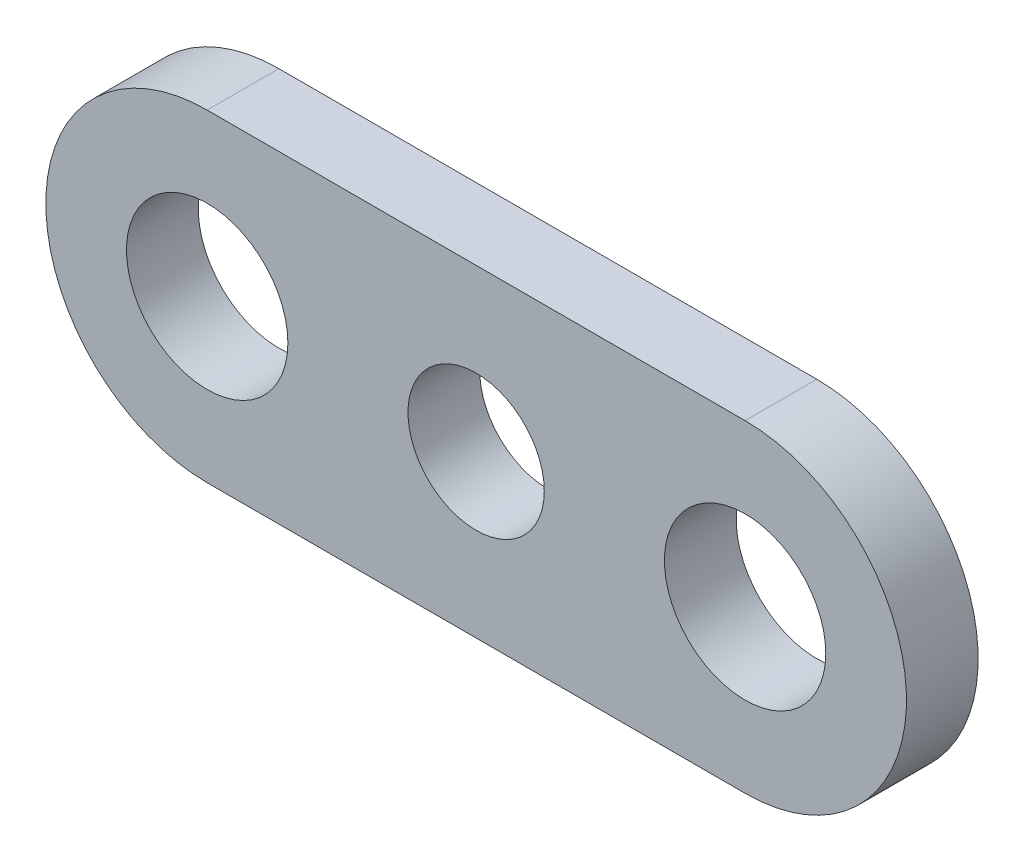
ISO-10303-21;
HEADER;
FILE_DESCRIPTION(('STEP AP214'),'2;1');
FILE_NAME('part.step','',(''),(''),'','','');
FILE_SCHEMA(('AUTOMOTIVE_DESIGN { 1 0 10303 214 1 1 1 1 }'));
ENDSEC;
DATA;
#1=APPLICATION_CONTEXT('core data for automotive mechanical design processes');
#2=APPLICATION_PROTOCOL_DEFINITION('international standard','automotive_design',2000,#1);
#3=PRODUCT_CONTEXT('',#1,'mechanical');
#4=PRODUCT('Part','Part','',(#3));
#5=PRODUCT_RELATED_PRODUCT_CATEGORY('part','',(#4));
#6=PRODUCT_DEFINITION_FORMATION('','',#4);
#7=PRODUCT_DEFINITION_CONTEXT('part definition',#1,'design');
#8=PRODUCT_DEFINITION('design','',#6,#7);
#9=PRODUCT_DEFINITION_SHAPE('','',#8);
#10=(LENGTH_UNIT() NAMED_UNIT(*) SI_UNIT(.MILLI.,.METRE.));
#11=(NAMED_UNIT(*) PLANE_ANGLE_UNIT() SI_UNIT($,.RADIAN.));
#12=(NAMED_UNIT(*) SI_UNIT($,.STERADIAN.) SOLID_ANGLE_UNIT());
#13=UNCERTAINTY_MEASURE_WITH_UNIT(LENGTH_MEASURE(1.E-05),#10,'distance_accuracy_value','');
#14=(GEOMETRIC_REPRESENTATION_CONTEXT(3) GLOBAL_UNCERTAINTY_ASSIGNED_CONTEXT((#13)) GLOBAL_UNIT_ASSIGNED_CONTEXT((#10,
#11,#12)) REPRESENTATION_CONTEXT('',''));
#15=CARTESIAN_POINT('',(0.,0.,0.));
#16=DIRECTION('',(0.,0.,1.));
#17=DIRECTION('',(1.,0.,0.));
#18=AXIS2_PLACEMENT_3D('',#15,#16,#17);
#19=CARTESIAN_POINT('',(-7.5,0.,2.));
#20=DIRECTION('',(0.,0.,1.));
#21=DIRECTION('',(1.,0.,0.));
#22=AXIS2_PLACEMENT_3D('',#19,#20,#21);
#23=PLANE('',#22);
#24=CARTESIAN_POINT('',(-7.5,0.,2.));
#25=DIRECTION('',(0.,0.,1.));
#26=DIRECTION('',(1.,0.,0.));
#27=AXIS2_PLACEMENT_3D('',#24,#25,#26);
#28=CIRCLE('',#27,2.24999999999999);
#29=CARTESIAN_POINT('',(-5.25000000000001,0.,2.));
#30=VERTEX_POINT('',#29);
#31=EDGE_CURVE('E149',#30,#30,#28,.T.);
#32=ORIENTED_EDGE('',*,*,#31,.F.);
#33=EDGE_LOOP('',(#32));
#34=FACE_BOUND('',#33,.T.);
#35=CARTESIAN_POINT('',(7.5,0.,2.));
#36=DIRECTION('',(0.,0.,1.));
#37=DIRECTION('',(1.,0.,0.));
#38=AXIS2_PLACEMENT_3D('',#35,#36,#37);
#39=CIRCLE('',#38,2.24999999999999);
#40=CARTESIAN_POINT('',(9.74999999999999,0.,2.));
#41=VERTEX_POINT('',#40);
#42=EDGE_CURVE('E142',#41,#41,#39,.T.);
#43=ORIENTED_EDGE('',*,*,#42,.F.);
#44=EDGE_LOOP('',(#43));
#45=FACE_BOUND('',#44,.T.);
#46=CARTESIAN_POINT('',(-7.5,0.,2.));
#47=DIRECTION('',(0.,0.,1.));
#48=DIRECTION('',(1.,0.,0.));
#49=AXIS2_PLACEMENT_3D('',#46,#47,#48);
#50=CIRCLE('',#49,4.5);
#51=CARTESIAN_POINT('',(-7.5,4.5,2.));
#52=VERTEX_POINT('',#51);
#53=CARTESIAN_POINT('',(-7.5,-4.5,2.));
#54=VERTEX_POINT('',#53);
#55=EDGE_CURVE('E92',#52,#54,#50,.T.);
#56=ORIENTED_EDGE('',*,*,#55,.T.);
#57=DIRECTION('',(1.,0.,0.));
#58=VECTOR('',#57,1.);
#59=CARTESIAN_POINT('',(-7.5,-4.5,2.));
#60=LINE('',#59,#58);
#61=CARTESIAN_POINT('',(7.5,-4.5,2.));
#62=VERTEX_POINT('',#61);
#63=EDGE_CURVE('E87',#54,#62,#60,.T.);
#64=ORIENTED_EDGE('',*,*,#63,.T.);
#65=CARTESIAN_POINT('',(7.5,0.,2.));
#66=DIRECTION('',(0.,0.,1.));
#67=DIRECTION('',(1.,0.,0.));
#68=AXIS2_PLACEMENT_3D('',#65,#66,#67);
#69=CIRCLE('',#68,4.5);
#70=CARTESIAN_POINT('',(7.5,4.5,2.));
#71=VERTEX_POINT('',#70);
#72=EDGE_CURVE('E90',#62,#71,#69,.T.);
#73=ORIENTED_EDGE('',*,*,#72,.T.);
#74=DIRECTION('',(-1.,0.,0.));
#75=VECTOR('',#74,1.);
#76=CARTESIAN_POINT('',(-7.5,4.5,2.));
#77=LINE('',#76,#75);
#78=EDGE_CURVE('E57',#71,#52,#77,.T.);
#79=ORIENTED_EDGE('',*,*,#78,.T.);
#80=EDGE_LOOP('',(#56,#64,#73,#79));
#81=FACE_BOUND('',#80,.T.);
#82=CARTESIAN_POINT('',(0.,0.,2.));
#83=DIRECTION('',(0.,0.,1.));
#84=DIRECTION('',(1.,0.,0.));
#85=AXIS2_PLACEMENT_3D('',#82,#83,#84);
#86=CIRCLE('',#85,1.9);
#87=CARTESIAN_POINT('',(1.9,0.,2.));
#88=VERTEX_POINT('',#87);
#89=EDGE_CURVE('E112',#88,#88,#86,.T.);
#90=ORIENTED_EDGE('',*,*,#89,.F.);
#91=EDGE_LOOP('',(#90));
#92=FACE_BOUND('',#91,.T.);
#93=ADVANCED_FACE('F39',(#34,#45,#81,#92),#23,.T.);
#94=CARTESIAN_POINT('',(-7.5,0.,0.));
#95=DIRECTION('',(0.,0.,1.));
#96=DIRECTION('',(1.,0.,0.));
#97=AXIS2_PLACEMENT_3D('',#94,#95,#96);
#98=PLANE('',#97);
#99=CARTESIAN_POINT('',(-7.5,0.,0.));
#100=DIRECTION('',(0.,0.,1.));
#101=DIRECTION('',(1.,0.,0.));
#102=AXIS2_PLACEMENT_3D('',#99,#100,#101);
#103=CIRCLE('',#102,2.25);
#104=CARTESIAN_POINT('',(-5.25,0.,0.));
#105=VERTEX_POINT('',#104);
#106=EDGE_CURVE('E146',#105,#105,#103,.T.);
#107=ORIENTED_EDGE('',*,*,#106,.T.);
#108=EDGE_LOOP('',(#107));
#109=FACE_BOUND('',#108,.T.);
#110=CARTESIAN_POINT('',(7.5,0.,0.));
#111=DIRECTION('',(0.,0.,1.));
#112=DIRECTION('',(1.,0.,0.));
#113=AXIS2_PLACEMENT_3D('',#110,#111,#112);
#114=CIRCLE('',#113,2.25);
#115=CARTESIAN_POINT('',(9.75,0.,0.));
#116=VERTEX_POINT('',#115);
#117=EDGE_CURVE('E136',#116,#116,#114,.T.);
#118=ORIENTED_EDGE('',*,*,#117,.T.);
#119=EDGE_LOOP('',(#118));
#120=FACE_BOUND('',#119,.T.);
#121=CARTESIAN_POINT('',(-7.5,0.,0.));
#122=DIRECTION('',(0.,0.,1.));
#123=DIRECTION('',(1.,0.,0.));
#124=AXIS2_PLACEMENT_3D('',#121,#122,#123);
#125=CIRCLE('',#124,4.5);
#126=CARTESIAN_POINT('',(-7.5,4.5,0.));
#127=VERTEX_POINT('',#126);
#128=CARTESIAN_POINT('',(-7.5,-4.5,0.));
#129=VERTEX_POINT('',#128);
#130=EDGE_CURVE('E109',#127,#129,#125,.T.);
#131=ORIENTED_EDGE('',*,*,#130,.F.);
#132=DIRECTION('',(-1.,0.,0.));
#133=VECTOR('',#132,1.);
#134=CARTESIAN_POINT('',(-7.5,4.5,0.));
#135=LINE('',#134,#133);
#136=CARTESIAN_POINT('',(7.5,4.5,0.));
#137=VERTEX_POINT('',#136);
#138=EDGE_CURVE('E80',#137,#127,#135,.T.);
#139=ORIENTED_EDGE('',*,*,#138,.F.);
#140=CARTESIAN_POINT('',(7.5,0.,0.));
#141=DIRECTION('',(0.,0.,1.));
#142=DIRECTION('',(1.,0.,0.));
#143=AXIS2_PLACEMENT_3D('',#140,#141,#142);
#144=CIRCLE('',#143,4.5);
#145=CARTESIAN_POINT('',(7.5,-4.5,0.));
#146=VERTEX_POINT('',#145);
#147=EDGE_CURVE('E74',#146,#137,#144,.T.);
#148=ORIENTED_EDGE('',*,*,#147,.F.);
#149=DIRECTION('',(1.,0.,0.));
#150=VECTOR('',#149,1.);
#151=CARTESIAN_POINT('',(-7.5,-4.5,0.));
#152=LINE('',#151,#150);
#153=EDGE_CURVE('E97',#129,#146,#152,.T.);
#154=ORIENTED_EDGE('',*,*,#153,.F.);
#155=EDGE_LOOP('',(#131,#139,#148,#154));
#156=FACE_BOUND('',#155,.T.);
#157=CARTESIAN_POINT('',(0.,0.,0.));
#158=DIRECTION('',(0.,0.,1.));
#159=DIRECTION('',(1.,0.,0.));
#160=AXIS2_PLACEMENT_3D('',#157,#158,#159);
#161=CIRCLE('',#160,1.9);
#162=CARTESIAN_POINT('',(1.9,0.,0.));
#163=VERTEX_POINT('',#162);
#164=EDGE_CURVE('E133',#163,#163,#161,.T.);
#165=ORIENTED_EDGE('',*,*,#164,.T.);
#166=EDGE_LOOP('',(#165));
#167=FACE_BOUND('',#166,.T.);
#168=ADVANCED_FACE('F126',(#109,#120,#156,#167),#98,.F.);
#169=CARTESIAN_POINT('',(-7.5,0.,2.));
#170=DIRECTION('',(0.,0.,-1.));
#171=DIRECTION('',(-1.,0.,0.));
#172=AXIS2_PLACEMENT_3D('',#169,#170,#171);
#173=CYLINDRICAL_SURFACE('',#172,4.5);
#174=ORIENTED_EDGE('',*,*,#130,.T.);
#175=DIRECTION('',(0.,0.,-1.));
#176=VECTOR('',#175,1.);
#177=CARTESIAN_POINT('',(-7.5,-4.5,2.));
#178=LINE('',#177,#176);
#179=EDGE_CURVE('E11',#54,#129,#178,.T.);
#180=ORIENTED_EDGE('',*,*,#179,.F.);
#181=ORIENTED_EDGE('',*,*,#55,.F.);
#182=DIRECTION('',(0.,0.,-1.));
#183=VECTOR('',#182,1.);
#184=CARTESIAN_POINT('',(-7.5,4.5,2.));
#185=LINE('',#184,#183);
#186=EDGE_CURVE('E105',#52,#127,#185,.T.);
#187=ORIENTED_EDGE('',*,*,#186,.T.);
#188=EDGE_LOOP('',(#174,#180,#181,#187));
#189=FACE_BOUND('',#188,.T.);
#190=ADVANCED_FACE('F41',(#189),#173,.T.);
#191=CARTESIAN_POINT('',(-7.5,-4.5,2.));
#192=DIRECTION('',(0.,1.,0.));
#193=DIRECTION('',(-1.,0.,0.));
#194=AXIS2_PLACEMENT_3D('',#191,#192,#193);
#195=PLANE('',#194);
#196=ORIENTED_EDGE('',*,*,#153,.T.);
#197=DIRECTION('',(0.,0.,-1.));
#198=VECTOR('',#197,1.);
#199=CARTESIAN_POINT('',(7.5,-4.5,2.));
#200=LINE('',#199,#198);
#201=EDGE_CURVE('E49',#62,#146,#200,.T.);
#202=ORIENTED_EDGE('',*,*,#201,.F.);
#203=ORIENTED_EDGE('',*,*,#63,.F.);
#204=ORIENTED_EDGE('',*,*,#179,.T.);
#205=EDGE_LOOP('',(#196,#202,#203,#204));
#206=FACE_BOUND('',#205,.T.);
#207=ADVANCED_FACE('F96',(#206),#195,.F.);
#208=CARTESIAN_POINT('',(7.5,0.,2.));
#209=DIRECTION('',(0.,0.,-1.));
#210=DIRECTION('',(-1.,0.,0.));
#211=AXIS2_PLACEMENT_3D('',#208,#209,#210);
#212=CYLINDRICAL_SURFACE('',#211,4.5);
#213=ORIENTED_EDGE('',*,*,#147,.T.);
#214=DIRECTION('',(0.,0.,-1.));
#215=VECTOR('',#214,1.);
#216=CARTESIAN_POINT('',(7.5,4.5,2.));
#217=LINE('',#216,#215);
#218=EDGE_CURVE('E99',#71,#137,#217,.T.);
#219=ORIENTED_EDGE('',*,*,#218,.F.);
#220=ORIENTED_EDGE('',*,*,#72,.F.);
#221=ORIENTED_EDGE('',*,*,#201,.T.);
#222=EDGE_LOOP('',(#213,#219,#220,#221));
#223=FACE_BOUND('',#222,.T.);
#224=ADVANCED_FACE('F100',(#223),#212,.T.);
#225=CARTESIAN_POINT('',(-7.5,4.5,2.));
#226=DIRECTION('',(0.,-1.,0.));
#227=DIRECTION('',(1.,0.,0.));
#228=AXIS2_PLACEMENT_3D('',#225,#226,#227);
#229=PLANE('',#228);
#230=ORIENTED_EDGE('',*,*,#138,.T.);
#231=ORIENTED_EDGE('',*,*,#186,.F.);
#232=ORIENTED_EDGE('',*,*,#78,.F.);
#233=ORIENTED_EDGE('',*,*,#218,.T.);
#234=EDGE_LOOP('',(#230,#231,#232,#233));
#235=FACE_BOUND('',#234,.T.);
#236=ADVANCED_FACE('F123',(#235),#229,.F.);
#237=CARTESIAN_POINT('',(0.,0.,2.));
#238=DIRECTION('',(0.,0.,-1.));
#239=DIRECTION('',(-1.,0.,0.));
#240=AXIS2_PLACEMENT_3D('',#237,#238,#239);
#241=CYLINDRICAL_SURFACE('',#240,1.9);
#242=ORIENTED_EDGE('',*,*,#89,.T.);
#243=EDGE_LOOP('',(#242));
#244=FACE_BOUND('',#243,.T.);
#245=ORIENTED_EDGE('',*,*,#164,.F.);
#246=EDGE_LOOP('',(#245));
#247=FACE_BOUND('',#246,.T.);
#248=ADVANCED_FACE('F163',(#244,#247),#241,.F.);
#249=CARTESIAN_POINT('',(7.5,0.,2.));
#250=DIRECTION('',(0.,0.,1.));
#251=DIRECTION('',(1.,0.,0.));
#252=AXIS2_PLACEMENT_3D('',#249,#250,#251);
#253=CYLINDRICAL_SURFACE('',#252,2.24999999999999);
#254=ORIENTED_EDGE('',*,*,#117,.F.);
#255=EDGE_LOOP('',(#254));
#256=FACE_BOUND('',#255,.T.);
#257=ORIENTED_EDGE('',*,*,#42,.T.);
#258=EDGE_LOOP('',(#257));
#259=FACE_BOUND('',#258,.T.);
#260=ADVANCED_FACE('F161',(#256,#259),#253,.F.);
#261=CARTESIAN_POINT('',(-7.5,0.,2.));
#262=DIRECTION('',(0.,0.,1.));
#263=DIRECTION('',(1.,0.,0.));
#264=AXIS2_PLACEMENT_3D('',#261,#262,#263);
#265=CYLINDRICAL_SURFACE('',#264,2.24999999999999);
#266=ORIENTED_EDGE('',*,*,#106,.F.);
#267=EDGE_LOOP('',(#266));
#268=FACE_BOUND('',#267,.T.);
#269=ORIENTED_EDGE('',*,*,#31,.T.);
#270=EDGE_LOOP('',(#269));
#271=FACE_BOUND('',#270,.T.);
#272=ADVANCED_FACE('F154',(#268,#271),#265,.F.);
#273=CLOSED_SHELL('',(#93,#168,#190,#207,#224,#236,#248,#260,#272));
#274=MANIFOLD_SOLID_BREP('B2',#273);
#275=ADVANCED_BREP_SHAPE_REPRESENTATION('',(#18,#274),#14);
#276=SHAPE_DEFINITION_REPRESENTATION(#9,#275);
ENDSEC;
END-ISO-10303-21;
